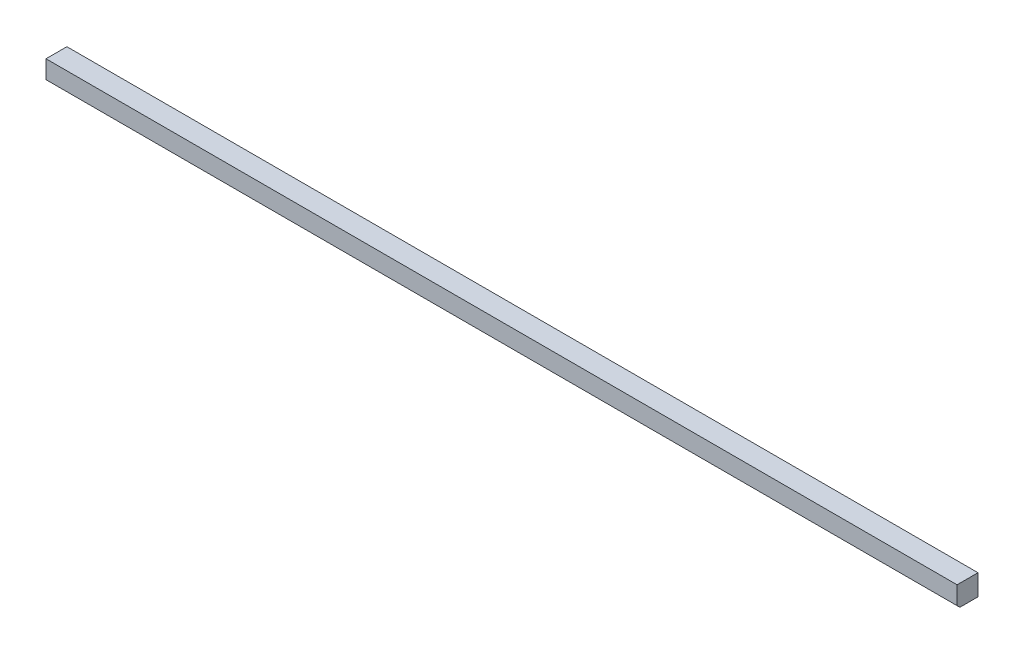
ISO-10303-21;
HEADER;
FILE_DESCRIPTION(('STEP AP214'),'2;1');
FILE_NAME('part.step','',(''),(''),'','','');
FILE_SCHEMA(('AUTOMOTIVE_DESIGN { 1 0 10303 214 1 1 1 1 }'));
ENDSEC;
DATA;
#1=APPLICATION_CONTEXT('core data for automotive mechanical design processes');
#2=APPLICATION_PROTOCOL_DEFINITION('international standard','automotive_design',2000,#1);
#3=PRODUCT_CONTEXT('',#1,'mechanical');
#4=PRODUCT('Part','Part','',(#3));
#5=PRODUCT_RELATED_PRODUCT_CATEGORY('part','',(#4));
#6=PRODUCT_DEFINITION_FORMATION('','',#4);
#7=PRODUCT_DEFINITION_CONTEXT('part definition',#1,'design');
#8=PRODUCT_DEFINITION('design','',#6,#7);
#9=PRODUCT_DEFINITION_SHAPE('','',#8);
#10=(LENGTH_UNIT() NAMED_UNIT(*) SI_UNIT(.MILLI.,.METRE.));
#11=(NAMED_UNIT(*) PLANE_ANGLE_UNIT() SI_UNIT($,.RADIAN.));
#12=(NAMED_UNIT(*) SI_UNIT($,.STERADIAN.) SOLID_ANGLE_UNIT());
#13=UNCERTAINTY_MEASURE_WITH_UNIT(LENGTH_MEASURE(1.E-05),#10,'distance_accuracy_value','');
#14=(GEOMETRIC_REPRESENTATION_CONTEXT(3) GLOBAL_UNCERTAINTY_ASSIGNED_CONTEXT((#13)) GLOBAL_UNIT_ASSIGNED_CONTEXT((#10,
#11,#12)) REPRESENTATION_CONTEXT('',''));
#15=CARTESIAN_POINT('',(0.,0.,0.));
#16=DIRECTION('',(0.,0.,1.));
#17=DIRECTION('',(1.,0.,0.));
#18=AXIS2_PLACEMENT_3D('',#15,#16,#17);
#19=CARTESIAN_POINT('',(0.,19.05,0.));
#20=DIRECTION('',(1.,0.,0.));
#21=DIRECTION('',(0.,0.,-1.));
#22=AXIS2_PLACEMENT_3D('',#19,#20,#21);
#23=PLANE('',#22);
#24=DIRECTION('',(0.,0.,1.));
#25=VECTOR('',#24,1.);
#26=CARTESIAN_POINT('',(0.,0.,0.));
#27=LINE('',#26,#25);
#28=CARTESIAN_POINT('',(0.,0.,-19.05));
#29=VERTEX_POINT('',#28);
#30=CARTESIAN_POINT('',(0.,0.,-2.53999999999998));
#31=VERTEX_POINT('',#30);
#32=EDGE_CURVE('E125',#29,#31,#27,.T.);
#33=ORIENTED_EDGE('',*,*,#32,.T.);
#34=DIRECTION('',(0.,0.707106781186548,0.707106781186547));
#35=VECTOR('',#34,1.);
#36=CARTESIAN_POINT('',(0.,2.53999999999999,0.));
#37=LINE('',#36,#35);
#38=CARTESIAN_POINT('',(0.,2.53999999999999,0.));
#39=VERTEX_POINT('',#38);
#40=EDGE_CURVE('E11',#31,#39,#37,.T.);
#41=ORIENTED_EDGE('',*,*,#40,.T.);
#42=DIRECTION('',(0.,-1.,0.));
#43=VECTOR('',#42,1.);
#44=CARTESIAN_POINT('',(0.,19.05,0.));
#45=LINE('',#44,#43);
#46=CARTESIAN_POINT('',(0.,19.05,0.));
#47=VERTEX_POINT('',#46);
#48=EDGE_CURVE('E93',#47,#39,#45,.T.);
#49=ORIENTED_EDGE('',*,*,#48,.F.);
#50=DIRECTION('',(0.,0.,1.));
#51=VECTOR('',#50,1.);
#52=CARTESIAN_POINT('',(0.,19.05,0.));
#53=LINE('',#52,#51);
#54=CARTESIAN_POINT('',(0.,19.05,-19.05));
#55=VERTEX_POINT('',#54);
#56=EDGE_CURVE('E99',#55,#47,#53,.T.);
#57=ORIENTED_EDGE('',*,*,#56,.F.);
#58=DIRECTION('',(0.,-1.,0.));
#59=VECTOR('',#58,1.);
#60=CARTESIAN_POINT('',(0.,19.05,-19.05));
#61=LINE('',#60,#59);
#62=EDGE_CURVE('E120',#55,#29,#61,.T.);
#63=ORIENTED_EDGE('',*,*,#62,.T.);
#64=EDGE_LOOP('',(#33,#41,#49,#57,#63));
#65=FACE_BOUND('',#64,.T.);
#66=ADVANCED_FACE('F41',(#65),#23,.F.);
#67=CARTESIAN_POINT('',(0.,19.05,0.));
#68=DIRECTION('',(0.,0.,-1.));
#69=DIRECTION('',(-1.,0.,0.));
#70=AXIS2_PLACEMENT_3D('',#67,#68,#69);
#71=PLANE('',#70);
#72=ORIENTED_EDGE('',*,*,#48,.T.);
#73=DIRECTION('',(1.,0.,0.));
#74=VECTOR('',#73,1.);
#75=CARTESIAN_POINT('',(830.2752,2.53999999999999,0.));
#76=LINE('',#75,#74);
#77=CARTESIAN_POINT('',(830.2752,2.53999999999999,0.));
#78=VERTEX_POINT('',#77);
#79=EDGE_CURVE('E111',#39,#78,#76,.T.);
#80=ORIENTED_EDGE('',*,*,#79,.T.);
#81=DIRECTION('',(0.,-1.,0.));
#82=VECTOR('',#81,1.);
#83=CARTESIAN_POINT('',(830.2752,19.05,0.));
#84=LINE('',#83,#82);
#85=CARTESIAN_POINT('',(830.2752,19.05,0.));
#86=VERTEX_POINT('',#85);
#87=EDGE_CURVE('E95',#86,#78,#84,.T.);
#88=ORIENTED_EDGE('',*,*,#87,.F.);
#89=DIRECTION('',(1.,0.,0.));
#90=VECTOR('',#89,1.);
#91=CARTESIAN_POINT('',(0.,19.05,0.));
#92=LINE('',#91,#90);
#93=EDGE_CURVE('E88',#47,#86,#92,.T.);
#94=ORIENTED_EDGE('',*,*,#93,.F.);
#95=EDGE_LOOP('',(#72,#80,#88,#94));
#96=FACE_BOUND('',#95,.T.);
#97=ADVANCED_FACE('F90',(#96),#71,.F.);
#98=CARTESIAN_POINT('',(830.2752,19.05,0.));
#99=DIRECTION('',(-1.,0.,0.));
#100=DIRECTION('',(0.,0.,1.));
#101=AXIS2_PLACEMENT_3D('',#98,#99,#100);
#102=PLANE('',#101);
#103=ORIENTED_EDGE('',*,*,#87,.T.);
#104=DIRECTION('',(0.,-0.707106781186548,-0.707106781186547));
#105=VECTOR('',#104,1.);
#106=CARTESIAN_POINT('',(830.2752,2.53999999999999,0.));
#107=LINE('',#106,#105);
#108=CARTESIAN_POINT('',(830.2752,0.,-2.53999999999998));
#109=VERTEX_POINT('',#108);
#110=EDGE_CURVE('E64',#78,#109,#107,.T.);
#111=ORIENTED_EDGE('',*,*,#110,.T.);
#112=DIRECTION('',(0.,0.,-1.));
#113=VECTOR('',#112,1.);
#114=CARTESIAN_POINT('',(830.2752,0.,0.));
#115=LINE('',#114,#113);
#116=CARTESIAN_POINT('',(830.2752,0.,-19.05));
#117=VERTEX_POINT('',#116);
#118=EDGE_CURVE('E123',#109,#117,#115,.T.);
#119=ORIENTED_EDGE('',*,*,#118,.T.);
#120=DIRECTION('',(0.,-1.,0.));
#121=VECTOR('',#120,1.);
#122=CARTESIAN_POINT('',(830.2752,19.05,-19.05));
#123=LINE('',#122,#121);
#124=CARTESIAN_POINT('',(830.2752,19.05,-19.05));
#125=VERTEX_POINT('',#124);
#126=EDGE_CURVE('E114',#125,#117,#123,.T.);
#127=ORIENTED_EDGE('',*,*,#126,.F.);
#128=DIRECTION('',(0.,0.,-1.));
#129=VECTOR('',#128,1.);
#130=CARTESIAN_POINT('',(830.2752,19.05,0.));
#131=LINE('',#130,#129);
#132=EDGE_CURVE('E98',#86,#125,#131,.T.);
#133=ORIENTED_EDGE('',*,*,#132,.F.);
#134=EDGE_LOOP('',(#103,#111,#119,#127,#133));
#135=FACE_BOUND('',#134,.T.);
#136=ADVANCED_FACE('F129',(#135),#102,.F.);
#137=CARTESIAN_POINT('',(0.,19.05,-19.05));
#138=DIRECTION('',(0.,0.,1.));
#139=DIRECTION('',(1.,0.,0.));
#140=AXIS2_PLACEMENT_3D('',#137,#138,#139);
#141=PLANE('',#140);
#142=DIRECTION('',(-1.,0.,0.));
#143=VECTOR('',#142,1.);
#144=CARTESIAN_POINT('',(0.,0.,-19.05));
#145=LINE('',#144,#143);
#146=EDGE_CURVE('E108',#117,#29,#145,.T.);
#147=ORIENTED_EDGE('',*,*,#146,.T.);
#148=ORIENTED_EDGE('',*,*,#62,.F.);
#149=DIRECTION('',(-1.,0.,0.));
#150=VECTOR('',#149,1.);
#151=CARTESIAN_POINT('',(0.,19.05,-19.05));
#152=LINE('',#151,#150);
#153=EDGE_CURVE('E104',#125,#55,#152,.T.);
#154=ORIENTED_EDGE('',*,*,#153,.F.);
#155=ORIENTED_EDGE('',*,*,#126,.T.);
#156=EDGE_LOOP('',(#147,#148,#154,#155));
#157=FACE_BOUND('',#156,.T.);
#158=ADVANCED_FACE('F132',(#157),#141,.F.);
#159=CARTESIAN_POINT('',(0.,19.05,0.));
#160=DIRECTION('',(0.,-1.,0.));
#161=DIRECTION('',(0.,0.,-1.));
#162=AXIS2_PLACEMENT_3D('',#159,#160,#161);
#163=PLANE('',#162);
#164=ORIENTED_EDGE('',*,*,#56,.T.);
#165=ORIENTED_EDGE('',*,*,#93,.T.);
#166=ORIENTED_EDGE('',*,*,#132,.T.);
#167=ORIENTED_EDGE('',*,*,#153,.T.);
#168=EDGE_LOOP('',(#164,#165,#166,#167));
#169=FACE_BOUND('',#168,.T.);
#170=ADVANCED_FACE('F102',(#169),#163,.F.);
#171=CARTESIAN_POINT('',(0.,0.,0.));
#172=DIRECTION('',(0.,-1.,0.));
#173=DIRECTION('',(0.,0.,-1.));
#174=AXIS2_PLACEMENT_3D('',#171,#172,#173);
#175=PLANE('',#174);
#176=ORIENTED_EDGE('',*,*,#118,.F.);
#177=DIRECTION('',(-1.,0.,0.));
#178=VECTOR('',#177,1.);
#179=CARTESIAN_POINT('',(0.,0.,-2.53999999999999));
#180=LINE('',#179,#178);
#181=EDGE_CURVE('E50',#109,#31,#180,.T.);
#182=ORIENTED_EDGE('',*,*,#181,.T.);
#183=ORIENTED_EDGE('',*,*,#32,.F.);
#184=ORIENTED_EDGE('',*,*,#146,.F.);
#185=EDGE_LOOP('',(#176,#182,#183,#184));
#186=FACE_BOUND('',#185,.T.);
#187=ADVANCED_FACE('F133',(#186),#175,.T.);
#188=CARTESIAN_POINT('',(0.,2.53999999999999,0.));
#189=DIRECTION('',(0.,-0.707106781186547,0.707106781186548));
#190=DIRECTION('',(-1.,0.,0.));
#191=AXIS2_PLACEMENT_3D('',#188,#189,#190);
#192=PLANE('',#191);
#193=ORIENTED_EDGE('',*,*,#40,.F.);
#194=ORIENTED_EDGE('',*,*,#181,.F.);
#195=ORIENTED_EDGE('',*,*,#110,.F.);
#196=ORIENTED_EDGE('',*,*,#79,.F.);
#197=EDGE_LOOP('',(#193,#194,#195,#196));
#198=FACE_BOUND('',#197,.T.);
#199=ADVANCED_FACE('F44',(#198),#192,.T.);
#200=CLOSED_SHELL('',(#66,#97,#136,#158,#170,#187,#199));
#201=MANIFOLD_SOLID_BREP('B2',#200);
#202=ADVANCED_BREP_SHAPE_REPRESENTATION('',(#18,#201),#14);
#203=SHAPE_DEFINITION_REPRESENTATION(#9,#202);
ENDSEC;
END-ISO-10303-21;
